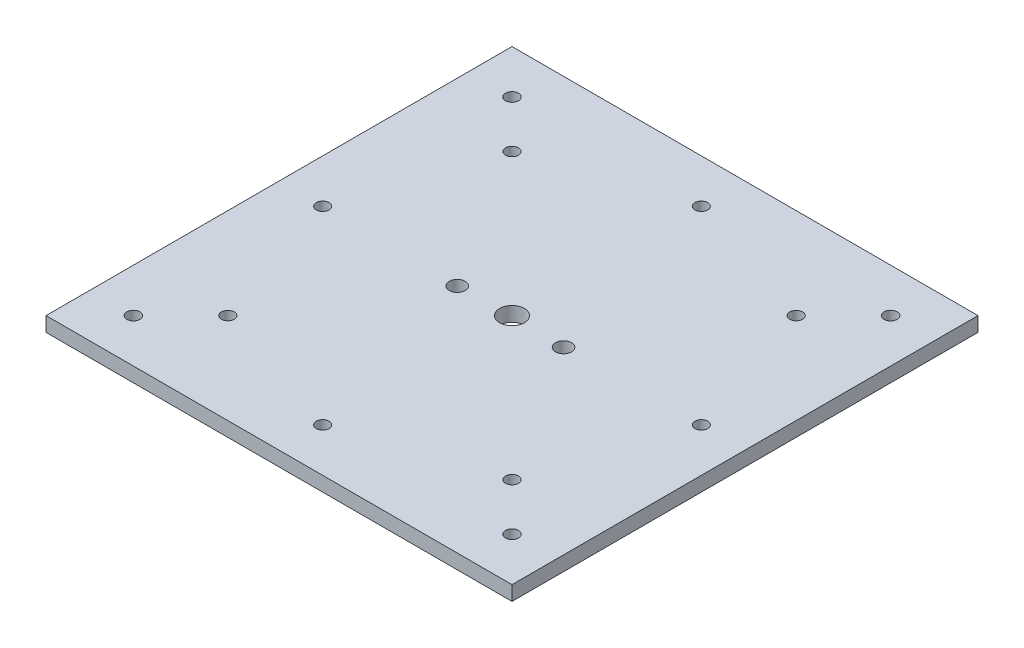
ISO-10303-21;
HEADER;
FILE_DESCRIPTION(('STEP AP214'),'2;1');
FILE_NAME('part.step','',(''),(''),'','','');
FILE_SCHEMA(('AUTOMOTIVE_DESIGN { 1 0 10303 214 1 1 1 1 }'));
ENDSEC;
DATA;
#1=APPLICATION_CONTEXT('core data for automotive mechanical design processes');
#2=APPLICATION_PROTOCOL_DEFINITION('international standard','automotive_design',2000,#1);
#3=PRODUCT_CONTEXT('',#1,'mechanical');
#4=PRODUCT('Part','Part','',(#3));
#5=PRODUCT_RELATED_PRODUCT_CATEGORY('part','',(#4));
#6=PRODUCT_DEFINITION_FORMATION('','',#4);
#7=PRODUCT_DEFINITION_CONTEXT('part definition',#1,'design');
#8=PRODUCT_DEFINITION('design','',#6,#7);
#9=PRODUCT_DEFINITION_SHAPE('','',#8);
#10=(LENGTH_UNIT() NAMED_UNIT(*) SI_UNIT(.MILLI.,.METRE.));
#11=(NAMED_UNIT(*) PLANE_ANGLE_UNIT() SI_UNIT($,.RADIAN.));
#12=(NAMED_UNIT(*) SI_UNIT($,.STERADIAN.) SOLID_ANGLE_UNIT());
#13=UNCERTAINTY_MEASURE_WITH_UNIT(LENGTH_MEASURE(1.E-05),#10,'distance_accuracy_value','');
#14=(GEOMETRIC_REPRESENTATION_CONTEXT(3) GLOBAL_UNCERTAINTY_ASSIGNED_CONTEXT((#13)) GLOBAL_UNIT_ASSIGNED_CONTEXT((#10,
#11,#12)) REPRESENTATION_CONTEXT('',''));
#15=CARTESIAN_POINT('',(0.,0.,0.));
#16=DIRECTION('',(0.,0.,1.));
#17=DIRECTION('',(1.,0.,0.));
#18=AXIS2_PLACEMENT_3D('',#15,#16,#17);
#19=CARTESIAN_POINT('',(0.,5.,0.));
#20=DIRECTION('',(0.,1.,0.));
#21=DIRECTION('',(0.,0.,1.));
#22=AXIS2_PLACEMENT_3D('',#19,#20,#21);
#23=PLANE('',#22);
#24=CARTESIAN_POINT('',(64.9999999999999,5.,65.));
#25=DIRECTION('',(0.,1.,0.));
#26=DIRECTION('',(0.,0.,1.));
#27=AXIS2_PLACEMENT_3D('',#24,#25,#26);
#28=CIRCLE('',#27,2.25);
#29=CARTESIAN_POINT('',(64.9999999999999,5.,67.25));
#30=VERTEX_POINT('',#29);
#31=EDGE_CURVE('E242',#30,#30,#28,.T.);
#32=ORIENTED_EDGE('',*,*,#31,.F.);
#33=EDGE_LOOP('',(#32));
#34=FACE_BOUND('',#33,.T.);
#35=CARTESIAN_POINT('',(-64.9999999999963,5.,3.69149155687865E-12));
#36=DIRECTION('',(0.,1.,0.));
#37=DIRECTION('',(0.,0.,1.));
#38=AXIS2_PLACEMENT_3D('',#35,#36,#37);
#39=CIRCLE('',#38,2.20000000000526);
#40=CARTESIAN_POINT('',(-64.9999999999963,5.,2.20000000000895));
#41=VERTEX_POINT('',#40);
#42=EDGE_CURVE('E226',#41,#41,#39,.T.);
#43=ORIENTED_EDGE('',*,*,#42,.F.);
#44=EDGE_LOOP('',(#43));
#45=FACE_BOUND('',#44,.T.);
#46=CARTESIAN_POINT('',(-18.2275786448242,5.,0.571625497658379));
#47=DIRECTION('',(0.,1.,0.));
#48=DIRECTION('',(0.,0.,1.));
#49=AXIS2_PLACEMENT_3D('',#46,#47,#48);
#50=CIRCLE('',#49,2.75);
#51=CARTESIAN_POINT('',(-18.2275786448242,5.,3.32162549765838));
#52=VERTEX_POINT('',#51);
#53=EDGE_CURVE('E210',#52,#52,#50,.T.);
#54=ORIENTED_EDGE('',*,*,#53,.F.);
#55=EDGE_LOOP('',(#54));
#56=FACE_BOUND('',#55,.T.);
#57=CARTESIAN_POINT('',(0.,5.,0.));
#58=DIRECTION('',(0.,1.,0.));
#59=DIRECTION('',(0.,0.,1.));
#60=AXIS2_PLACEMENT_3D('',#57,#58,#59);
#61=CIRCLE('',#60,4.25);
#62=CARTESIAN_POINT('',(0.,5.,4.25));
#63=VERTEX_POINT('',#62);
#64=EDGE_CURVE('E194',#63,#63,#61,.T.);
#65=ORIENTED_EDGE('',*,*,#64,.F.);
#66=EDGE_LOOP('',(#65));
#67=FACE_BOUND('',#66,.T.);
#68=CARTESIAN_POINT('',(65.0000000000037,5.,-3.66373598126302E-12));
#69=DIRECTION('',(0.,1.,0.));
#70=DIRECTION('',(0.,0.,1.));
#71=AXIS2_PLACEMENT_3D('',#68,#69,#70);
#72=CIRCLE('',#71,2.20000000000267);
#73=CARTESIAN_POINT('',(65.0000000000037,5.,2.199999999999));
#74=VERTEX_POINT('',#73);
#75=EDGE_CURVE('E178',#74,#74,#72,.T.);
#76=ORIENTED_EDGE('',*,*,#75,.F.);
#77=EDGE_LOOP('',(#76));
#78=FACE_BOUND('',#77,.T.);
#79=CARTESIAN_POINT('',(-65.,5.,-65.));
#80=DIRECTION('',(0.,1.,0.));
#81=DIRECTION('',(0.,0.,1.));
#82=AXIS2_PLACEMENT_3D('',#79,#80,#81);
#83=CIRCLE('',#82,2.25);
#84=CARTESIAN_POINT('',(-65.,5.,-62.75));
#85=VERTEX_POINT('',#84);
#86=EDGE_CURVE('E162',#85,#85,#83,.T.);
#87=ORIENTED_EDGE('',*,*,#86,.F.);
#88=EDGE_LOOP('',(#87));
#89=FACE_BOUND('',#88,.T.);
#90=CARTESIAN_POINT('',(48.7903679018732,5.,-48.7903679018752));
#91=DIRECTION('',(0.,1.,0.));
#92=DIRECTION('',(0.,0.,1.));
#93=AXIS2_PLACEMENT_3D('',#90,#91,#92);
#94=CIRCLE('',#93,2.20000000000049);
#95=CARTESIAN_POINT('',(48.7903679018732,5.,-46.5903679018747));
#96=VERTEX_POINT('',#95);
#97=EDGE_CURVE('E146',#96,#96,#94,.T.);
#98=ORIENTED_EDGE('',*,*,#97,.F.);
#99=EDGE_LOOP('',(#98));
#100=FACE_BOUND('',#99,.T.);
#101=DIRECTION('',(0.,0.,-1.));
#102=VECTOR('',#101,1.);
#103=CARTESIAN_POINT('',(80.,5.,-80.));
#104=LINE('',#103,#102);
#105=CARTESIAN_POINT('',(80.,5.,80.));
#106=VERTEX_POINT('',#105);
#107=CARTESIAN_POINT('',(80.,5.,-80.));
#108=VERTEX_POINT('',#107);
#109=EDGE_CURVE('E101',#106,#108,#104,.T.);
#110=ORIENTED_EDGE('',*,*,#109,.T.);
#111=DIRECTION('',(-1.,0.,0.));
#112=VECTOR('',#111,1.);
#113=CARTESIAN_POINT('',(-80.,5.,-80.));
#114=LINE('',#113,#112);
#115=CARTESIAN_POINT('',(-80.,5.,-80.));
#116=VERTEX_POINT('',#115);
#117=EDGE_CURVE('E96',#108,#116,#114,.T.);
#118=ORIENTED_EDGE('',*,*,#117,.T.);
#119=DIRECTION('',(0.,0.,1.));
#120=VECTOR('',#119,1.);
#121=CARTESIAN_POINT('',(-80.,5.,-80.));
#122=LINE('',#121,#120);
#123=CARTESIAN_POINT('',(-80.,5.,80.));
#124=VERTEX_POINT('',#123);
#125=EDGE_CURVE('E99',#116,#124,#122,.T.);
#126=ORIENTED_EDGE('',*,*,#125,.T.);
#127=DIRECTION('',(1.,0.,0.));
#128=VECTOR('',#127,1.);
#129=CARTESIAN_POINT('',(-80.,5.,80.));
#130=LINE('',#129,#128);
#131=EDGE_CURVE('E66',#124,#106,#130,.T.);
#132=ORIENTED_EDGE('',*,*,#131,.T.);
#133=EDGE_LOOP('',(#110,#118,#126,#132));
#134=FACE_BOUND('',#133,.T.);
#135=CARTESIAN_POINT('',(0.,5.,-65.));
#136=DIRECTION('',(0.,1.,0.));
#137=DIRECTION('',(0.,0.,1.));
#138=AXIS2_PLACEMENT_3D('',#135,#136,#137);
#139=CIRCLE('',#138,2.2);
#140=CARTESIAN_POINT('',(0.,5.,-62.8));
#141=VERTEX_POINT('',#140);
#142=EDGE_CURVE('E122',#141,#141,#139,.T.);
#143=ORIENTED_EDGE('',*,*,#142,.F.);
#144=EDGE_LOOP('',(#143));
#145=FACE_BOUND('',#144,.T.);
#146=CARTESIAN_POINT('',(48.7903679018801,5.,48.7903679018683));
#147=DIRECTION('',(0.,1.,0.));
#148=DIRECTION('',(0.,0.,1.));
#149=AXIS2_PLACEMENT_3D('',#146,#147,#148);
#150=CIRCLE('',#149,2.20000000000736);
#151=CARTESIAN_POINT('',(48.7903679018801,5.,50.9903679018757));
#152=VERTEX_POINT('',#151);
#153=EDGE_CURVE('E154',#152,#152,#150,.T.);
#154=ORIENTED_EDGE('',*,*,#153,.F.);
#155=EDGE_LOOP('',(#154));
#156=FACE_BOUND('',#155,.T.);
#157=CARTESIAN_POINT('',(-48.7903679018634,5.,48.7903679018753));
#158=DIRECTION('',(0.,1.,0.));
#159=DIRECTION('',(0.,0.,1.));
#160=AXIS2_PLACEMENT_3D('',#157,#158,#159);
#161=CIRCLE('',#160,2.2000000000096);
#162=CARTESIAN_POINT('',(-48.7903679018634,5.,50.9903679018849));
#163=VERTEX_POINT('',#162);
#164=EDGE_CURVE('E170',#163,#163,#161,.T.);
#165=ORIENTED_EDGE('',*,*,#164,.F.);
#166=EDGE_LOOP('',(#165));
#167=FACE_BOUND('',#166,.T.);
#168=CARTESIAN_POINT('',(-48.7903679018704,5.,-48.7903679018683));
#169=DIRECTION('',(0.,1.,0.));
#170=DIRECTION('',(0.,0.,1.));
#171=AXIS2_PLACEMENT_3D('',#168,#169,#170);
#172=CIRCLE('',#171,2.20000000000323);
#173=CARTESIAN_POINT('',(-48.7903679018704,5.,-46.5903679018651));
#174=VERTEX_POINT('',#173);
#175=EDGE_CURVE('E186',#174,#174,#172,.T.);
#176=ORIENTED_EDGE('',*,*,#175,.F.);
#177=EDGE_LOOP('',(#176));
#178=FACE_BOUND('',#177,.T.);
#179=CARTESIAN_POINT('',(18.2724213551758,5.,0.571625497658379));
#180=DIRECTION('',(0.,1.,0.));
#181=DIRECTION('',(0.,0.,1.));
#182=AXIS2_PLACEMENT_3D('',#179,#180,#181);
#183=CIRCLE('',#182,2.74999999999999);
#184=CARTESIAN_POINT('',(18.2724213551758,5.,3.32162549765837));
#185=VERTEX_POINT('',#184);
#186=EDGE_CURVE('E202',#185,#185,#183,.T.);
#187=ORIENTED_EDGE('',*,*,#186,.F.);
#188=EDGE_LOOP('',(#187));
#189=FACE_BOUND('',#188,.T.);
#190=CARTESIAN_POINT('',(7.36910532594948E-12,5.,65.));
#191=DIRECTION('',(0.,1.,0.));
#192=DIRECTION('',(0.,0.,1.));
#193=AXIS2_PLACEMENT_3D('',#190,#191,#192);
#194=CIRCLE('',#193,2.2000000000075);
#195=CARTESIAN_POINT('',(7.36910532594948E-12,5.,67.2000000000075));
#196=VERTEX_POINT('',#195);
#197=EDGE_CURVE('E218',#196,#196,#194,.T.);
#198=ORIENTED_EDGE('',*,*,#197,.F.);
#199=EDGE_LOOP('',(#198));
#200=FACE_BOUND('',#199,.T.);
#201=CARTESIAN_POINT('',(65.,5.,-65.));
#202=DIRECTION('',(0.,1.,0.));
#203=DIRECTION('',(0.,0.,1.));
#204=AXIS2_PLACEMENT_3D('',#201,#202,#203);
#205=CIRCLE('',#204,2.25);
#206=CARTESIAN_POINT('',(65.,5.,-62.75));
#207=VERTEX_POINT('',#206);
#208=EDGE_CURVE('E234',#207,#207,#205,.T.);
#209=ORIENTED_EDGE('',*,*,#208,.F.);
#210=EDGE_LOOP('',(#209));
#211=FACE_BOUND('',#210,.T.);
#212=CARTESIAN_POINT('',(-65.0000000000001,5.,65.));
#213=DIRECTION('',(0.,1.,0.));
#214=DIRECTION('',(0.,0.,1.));
#215=AXIS2_PLACEMENT_3D('',#212,#213,#214);
#216=CIRCLE('',#215,2.25);
#217=CARTESIAN_POINT('',(-65.0000000000001,5.,67.25));
#218=VERTEX_POINT('',#217);
#219=EDGE_CURVE('E250',#218,#218,#216,.T.);
#220=ORIENTED_EDGE('',*,*,#219,.F.);
#221=EDGE_LOOP('',(#220));
#222=FACE_BOUND('',#221,.T.);
#223=ADVANCED_FACE('F48',(#34,#45,#56,#67,#78,#89,#100,#134,#145,#156,#167,#178,#189,#200,#211,
#222),#23,.T.);
#224=CARTESIAN_POINT('',(0.,0.,0.));
#225=DIRECTION('',(0.,1.,0.));
#226=DIRECTION('',(0.,0.,1.));
#227=AXIS2_PLACEMENT_3D('',#224,#225,#226);
#228=PLANE('',#227);
#229=DIRECTION('',(0.,0.,-1.));
#230=VECTOR('',#229,1.);
#231=CARTESIAN_POINT('',(80.,0.,-80.));
#232=LINE('',#231,#230);
#233=CARTESIAN_POINT('',(80.,0.,80.));
#234=VERTEX_POINT('',#233);
#235=CARTESIAN_POINT('',(80.,0.,-80.));
#236=VERTEX_POINT('',#235);
#237=EDGE_CURVE('E118',#234,#236,#232,.T.);
#238=ORIENTED_EDGE('',*,*,#237,.F.);
#239=DIRECTION('',(1.,0.,0.));
#240=VECTOR('',#239,1.);
#241=CARTESIAN_POINT('',(-80.,0.,80.));
#242=LINE('',#241,#240);
#243=CARTESIAN_POINT('',(-80.,0.,80.));
#244=VERTEX_POINT('',#243);
#245=EDGE_CURVE('E89',#244,#234,#242,.T.);
#246=ORIENTED_EDGE('',*,*,#245,.F.);
#247=DIRECTION('',(0.,0.,1.));
#248=VECTOR('',#247,1.);
#249=CARTESIAN_POINT('',(-80.,0.,-80.));
#250=LINE('',#249,#248);
#251=CARTESIAN_POINT('',(-80.,0.,-80.));
#252=VERTEX_POINT('',#251);
#253=EDGE_CURVE('E83',#252,#244,#250,.T.);
#254=ORIENTED_EDGE('',*,*,#253,.F.);
#255=DIRECTION('',(-1.,0.,0.));
#256=VECTOR('',#255,1.);
#257=CARTESIAN_POINT('',(-80.,0.,-80.));
#258=LINE('',#257,#256);
#259=EDGE_CURVE('E106',#236,#252,#258,.T.);
#260=ORIENTED_EDGE('',*,*,#259,.F.);
#261=EDGE_LOOP('',(#238,#246,#254,#260));
#262=FACE_BOUND('',#261,.T.);
#263=CARTESIAN_POINT('',(0.,0.,-65.));
#264=DIRECTION('',(0.,1.,0.));
#265=DIRECTION('',(0.,0.,1.));
#266=AXIS2_PLACEMENT_3D('',#263,#264,#265);
#267=CIRCLE('',#266,2.2);
#268=CARTESIAN_POINT('',(0.,0.,-62.8));
#269=VERTEX_POINT('',#268);
#270=EDGE_CURVE('E142',#269,#269,#267,.T.);
#271=ORIENTED_EDGE('',*,*,#270,.T.);
#272=EDGE_LOOP('',(#271));
#273=FACE_BOUND('',#272,.T.);
#274=CARTESIAN_POINT('',(48.7903679018732,0.,-48.7903679018752));
#275=DIRECTION('',(0.,1.,0.));
#276=DIRECTION('',(0.,0.,1.));
#277=AXIS2_PLACEMENT_3D('',#274,#275,#276);
#278=CIRCLE('',#277,2.20000000000049);
#279=CARTESIAN_POINT('',(48.7903679018732,0.,-46.5903679018747));
#280=VERTEX_POINT('',#279);
#281=EDGE_CURVE('E150',#280,#280,#278,.T.);
#282=ORIENTED_EDGE('',*,*,#281,.T.);
#283=EDGE_LOOP('',(#282));
#284=FACE_BOUND('',#283,.T.);
#285=CARTESIAN_POINT('',(48.7903679018801,0.,48.7903679018683));
#286=DIRECTION('',(0.,1.,0.));
#287=DIRECTION('',(0.,0.,1.));
#288=AXIS2_PLACEMENT_3D('',#285,#286,#287);
#289=CIRCLE('',#288,2.20000000000736);
#290=CARTESIAN_POINT('',(48.7903679018801,0.,50.9903679018757));
#291=VERTEX_POINT('',#290);
#292=EDGE_CURVE('E158',#291,#291,#289,.T.);
#293=ORIENTED_EDGE('',*,*,#292,.T.);
#294=EDGE_LOOP('',(#293));
#295=FACE_BOUND('',#294,.T.);
#296=CARTESIAN_POINT('',(-65.,0.,-65.));
#297=DIRECTION('',(0.,1.,0.));
#298=DIRECTION('',(0.,0.,1.));
#299=AXIS2_PLACEMENT_3D('',#296,#297,#298);
#300=CIRCLE('',#299,2.25);
#301=CARTESIAN_POINT('',(-65.,0.,-62.75));
#302=VERTEX_POINT('',#301);
#303=EDGE_CURVE('E166',#302,#302,#300,.T.);
#304=ORIENTED_EDGE('',*,*,#303,.T.);
#305=EDGE_LOOP('',(#304));
#306=FACE_BOUND('',#305,.T.);
#307=CARTESIAN_POINT('',(-48.7903679018634,0.,48.7903679018753));
#308=DIRECTION('',(0.,1.,0.));
#309=DIRECTION('',(0.,0.,1.));
#310=AXIS2_PLACEMENT_3D('',#307,#308,#309);
#311=CIRCLE('',#310,2.2000000000096);
#312=CARTESIAN_POINT('',(-48.7903679018634,0.,50.9903679018849));
#313=VERTEX_POINT('',#312);
#314=EDGE_CURVE('E174',#313,#313,#311,.T.);
#315=ORIENTED_EDGE('',*,*,#314,.T.);
#316=EDGE_LOOP('',(#315));
#317=FACE_BOUND('',#316,.T.);
#318=CARTESIAN_POINT('',(65.0000000000037,0.,-3.66373598126302E-12));
#319=DIRECTION('',(0.,1.,0.));
#320=DIRECTION('',(0.,0.,1.));
#321=AXIS2_PLACEMENT_3D('',#318,#319,#320);
#322=CIRCLE('',#321,2.20000000000267);
#323=CARTESIAN_POINT('',(65.0000000000037,0.,2.199999999999));
#324=VERTEX_POINT('',#323);
#325=EDGE_CURVE('E182',#324,#324,#322,.T.);
#326=ORIENTED_EDGE('',*,*,#325,.T.);
#327=EDGE_LOOP('',(#326));
#328=FACE_BOUND('',#327,.T.);
#329=CARTESIAN_POINT('',(-48.7903679018704,0.,-48.7903679018683));
#330=DIRECTION('',(0.,1.,0.));
#331=DIRECTION('',(0.,0.,1.));
#332=AXIS2_PLACEMENT_3D('',#329,#330,#331);
#333=CIRCLE('',#332,2.20000000000323);
#334=CARTESIAN_POINT('',(-48.7903679018704,0.,-46.5903679018651));
#335=VERTEX_POINT('',#334);
#336=EDGE_CURVE('E190',#335,#335,#333,.T.);
#337=ORIENTED_EDGE('',*,*,#336,.T.);
#338=EDGE_LOOP('',(#337));
#339=FACE_BOUND('',#338,.T.);
#340=CARTESIAN_POINT('',(0.,0.,0.));
#341=DIRECTION('',(0.,1.,0.));
#342=DIRECTION('',(0.,0.,1.));
#343=AXIS2_PLACEMENT_3D('',#340,#341,#342);
#344=CIRCLE('',#343,4.25);
#345=CARTESIAN_POINT('',(0.,0.,4.25));
#346=VERTEX_POINT('',#345);
#347=EDGE_CURVE('E198',#346,#346,#344,.T.);
#348=ORIENTED_EDGE('',*,*,#347,.T.);
#349=EDGE_LOOP('',(#348));
#350=FACE_BOUND('',#349,.T.);
#351=CARTESIAN_POINT('',(18.2724213551758,0.,0.571625497658379));
#352=DIRECTION('',(0.,1.,0.));
#353=DIRECTION('',(0.,0.,1.));
#354=AXIS2_PLACEMENT_3D('',#351,#352,#353);
#355=CIRCLE('',#354,2.74999999999999);
#356=CARTESIAN_POINT('',(18.2724213551758,0.,3.32162549765837));
#357=VERTEX_POINT('',#356);
#358=EDGE_CURVE('E206',#357,#357,#355,.T.);
#359=ORIENTED_EDGE('',*,*,#358,.T.);
#360=EDGE_LOOP('',(#359));
#361=FACE_BOUND('',#360,.T.);
#362=CARTESIAN_POINT('',(-18.2275786448242,0.,0.571625497658379));
#363=DIRECTION('',(0.,1.,0.));
#364=DIRECTION('',(0.,0.,1.));
#365=AXIS2_PLACEMENT_3D('',#362,#363,#364);
#366=CIRCLE('',#365,2.75);
#367=CARTESIAN_POINT('',(-18.2275786448242,0.,3.32162549765838));
#368=VERTEX_POINT('',#367);
#369=EDGE_CURVE('E214',#368,#368,#366,.T.);
#370=ORIENTED_EDGE('',*,*,#369,.T.);
#371=EDGE_LOOP('',(#370));
#372=FACE_BOUND('',#371,.T.);
#373=CARTESIAN_POINT('',(7.36910532594948E-12,0.,65.));
#374=DIRECTION('',(0.,1.,0.));
#375=DIRECTION('',(0.,0.,1.));
#376=AXIS2_PLACEMENT_3D('',#373,#374,#375);
#377=CIRCLE('',#376,2.2000000000075);
#378=CARTESIAN_POINT('',(7.36910532594948E-12,0.,67.2000000000075));
#379=VERTEX_POINT('',#378);
#380=EDGE_CURVE('E222',#379,#379,#377,.T.);
#381=ORIENTED_EDGE('',*,*,#380,.T.);
#382=EDGE_LOOP('',(#381));
#383=FACE_BOUND('',#382,.T.);
#384=CARTESIAN_POINT('',(-64.9999999999963,0.,3.69149155687865E-12));
#385=DIRECTION('',(0.,1.,0.));
#386=DIRECTION('',(0.,0.,1.));
#387=AXIS2_PLACEMENT_3D('',#384,#385,#386);
#388=CIRCLE('',#387,2.20000000000526);
#389=CARTESIAN_POINT('',(-64.9999999999963,0.,2.20000000000895));
#390=VERTEX_POINT('',#389);
#391=EDGE_CURVE('E230',#390,#390,#388,.T.);
#392=ORIENTED_EDGE('',*,*,#391,.T.);
#393=EDGE_LOOP('',(#392));
#394=FACE_BOUND('',#393,.T.);
#395=CARTESIAN_POINT('',(65.,0.,-65.));
#396=DIRECTION('',(0.,1.,0.));
#397=DIRECTION('',(0.,0.,1.));
#398=AXIS2_PLACEMENT_3D('',#395,#396,#397);
#399=CIRCLE('',#398,2.25);
#400=CARTESIAN_POINT('',(65.,0.,-62.75));
#401=VERTEX_POINT('',#400);
#402=EDGE_CURVE('E238',#401,#401,#399,.T.);
#403=ORIENTED_EDGE('',*,*,#402,.T.);
#404=EDGE_LOOP('',(#403));
#405=FACE_BOUND('',#404,.T.);
#406=CARTESIAN_POINT('',(64.9999999999999,0.,65.));
#407=DIRECTION('',(0.,1.,0.));
#408=DIRECTION('',(0.,0.,1.));
#409=AXIS2_PLACEMENT_3D('',#406,#407,#408);
#410=CIRCLE('',#409,2.25);
#411=CARTESIAN_POINT('',(64.9999999999999,0.,67.25));
#412=VERTEX_POINT('',#411);
#413=EDGE_CURVE('E246',#412,#412,#410,.T.);
#414=ORIENTED_EDGE('',*,*,#413,.T.);
#415=EDGE_LOOP('',(#414));
#416=FACE_BOUND('',#415,.T.);
#417=CARTESIAN_POINT('',(-65.0000000000001,0.,65.));
#418=DIRECTION('',(0.,1.,0.));
#419=DIRECTION('',(0.,0.,1.));
#420=AXIS2_PLACEMENT_3D('',#417,#418,#419);
#421=CIRCLE('',#420,2.25);
#422=CARTESIAN_POINT('',(-65.0000000000001,0.,67.25));
#423=VERTEX_POINT('',#422);
#424=EDGE_CURVE('E254',#423,#423,#421,.T.);
#425=ORIENTED_EDGE('',*,*,#424,.T.);
#426=EDGE_LOOP('',(#425));
#427=FACE_BOUND('',#426,.T.);
#428=ADVANCED_FACE('F136',(#262,#273,#284,#295,#306,#317,#328,#339,#350,#361,#372,#383,#394,
#405,#416,#427),#228,.F.);
#429=CARTESIAN_POINT('',(80.,5.,-80.));
#430=DIRECTION('',(-1.,0.,0.));
#431=DIRECTION('',(0.,0.,1.));
#432=AXIS2_PLACEMENT_3D('',#429,#430,#431);
#433=PLANE('',#432);
#434=ORIENTED_EDGE('',*,*,#237,.T.);
#435=DIRECTION('',(0.,-1.,0.));
#436=VECTOR('',#435,1.);
#437=CARTESIAN_POINT('',(80.,5.,-80.));
#438=LINE('',#437,#436);
#439=EDGE_CURVE('E13',#108,#236,#438,.T.);
#440=ORIENTED_EDGE('',*,*,#439,.F.);
#441=ORIENTED_EDGE('',*,*,#109,.F.);
#442=DIRECTION('',(0.,-1.,0.));
#443=VECTOR('',#442,1.);
#444=CARTESIAN_POINT('',(80.,5.,80.));
#445=LINE('',#444,#443);
#446=EDGE_CURVE('E114',#106,#234,#445,.T.);
#447=ORIENTED_EDGE('',*,*,#446,.T.);
#448=EDGE_LOOP('',(#434,#440,#441,#447));
#449=FACE_BOUND('',#448,.T.);
#450=ADVANCED_FACE('F50',(#449),#433,.F.);
#451=CARTESIAN_POINT('',(-80.,5.,-80.));
#452=DIRECTION('',(0.,0.,1.));
#453=DIRECTION('',(1.,0.,0.));
#454=AXIS2_PLACEMENT_3D('',#451,#452,#453);
#455=PLANE('',#454);
#456=ORIENTED_EDGE('',*,*,#259,.T.);
#457=DIRECTION('',(0.,-1.,0.));
#458=VECTOR('',#457,1.);
#459=CARTESIAN_POINT('',(-80.,5.,-80.));
#460=LINE('',#459,#458);
#461=EDGE_CURVE('E58',#116,#252,#460,.T.);
#462=ORIENTED_EDGE('',*,*,#461,.F.);
#463=ORIENTED_EDGE('',*,*,#117,.F.);
#464=ORIENTED_EDGE('',*,*,#439,.T.);
#465=EDGE_LOOP('',(#456,#462,#463,#464));
#466=FACE_BOUND('',#465,.T.);
#467=ADVANCED_FACE('F105',(#466),#455,.F.);
#468=CARTESIAN_POINT('',(-80.,5.,-80.));
#469=DIRECTION('',(1.,0.,0.));
#470=DIRECTION('',(0.,0.,-1.));
#471=AXIS2_PLACEMENT_3D('',#468,#469,#470);
#472=PLANE('',#471);
#473=ORIENTED_EDGE('',*,*,#253,.T.);
#474=DIRECTION('',(0.,-1.,0.));
#475=VECTOR('',#474,1.);
#476=CARTESIAN_POINT('',(-80.,5.,80.));
#477=LINE('',#476,#475);
#478=EDGE_CURVE('E108',#124,#244,#477,.T.);
#479=ORIENTED_EDGE('',*,*,#478,.F.);
#480=ORIENTED_EDGE('',*,*,#125,.F.);
#481=ORIENTED_EDGE('',*,*,#461,.T.);
#482=EDGE_LOOP('',(#473,#479,#480,#481));
#483=FACE_BOUND('',#482,.T.);
#484=ADVANCED_FACE('F109',(#483),#472,.F.);
#485=CARTESIAN_POINT('',(-80.,5.,80.));
#486=DIRECTION('',(0.,0.,-1.));
#487=DIRECTION('',(-1.,0.,0.));
#488=AXIS2_PLACEMENT_3D('',#485,#486,#487);
#489=PLANE('',#488);
#490=ORIENTED_EDGE('',*,*,#245,.T.);
#491=ORIENTED_EDGE('',*,*,#446,.F.);
#492=ORIENTED_EDGE('',*,*,#131,.F.);
#493=ORIENTED_EDGE('',*,*,#478,.T.);
#494=EDGE_LOOP('',(#490,#491,#492,#493));
#495=FACE_BOUND('',#494,.T.);
#496=ADVANCED_FACE('F133',(#495),#489,.F.);
#497=CARTESIAN_POINT('',(0.,5.,-65.));
#498=DIRECTION('',(0.,-1.,0.));
#499=DIRECTION('',(0.,0.,-1.));
#500=AXIS2_PLACEMENT_3D('',#497,#498,#499);
#501=CYLINDRICAL_SURFACE('',#500,2.2);
#502=ORIENTED_EDGE('',*,*,#142,.T.);
#503=EDGE_LOOP('',(#502));
#504=FACE_BOUND('',#503,.T.);
#505=ORIENTED_EDGE('',*,*,#270,.F.);
#506=EDGE_LOOP('',(#505));
#507=FACE_BOUND('',#506,.T.);
#508=ADVANCED_FACE('F276',(#504,#507),#501,.F.);
#509=CARTESIAN_POINT('',(48.7903679018732,5.,-48.7903679018752));
#510=DIRECTION('',(0.,-1.,0.));
#511=DIRECTION('',(0.,0.,-1.));
#512=AXIS2_PLACEMENT_3D('',#509,#510,#511);
#513=CYLINDRICAL_SURFACE('',#512,2.20000000000049);
#514=ORIENTED_EDGE('',*,*,#97,.T.);
#515=EDGE_LOOP('',(#514));
#516=FACE_BOUND('',#515,.T.);
#517=ORIENTED_EDGE('',*,*,#281,.F.);
#518=EDGE_LOOP('',(#517));
#519=FACE_BOUND('',#518,.T.);
#520=ADVANCED_FACE('F322',(#516,#519),#513,.F.);
#521=CARTESIAN_POINT('',(48.7903679018801,5.,48.7903679018683));
#522=DIRECTION('',(0.,-1.,0.));
#523=DIRECTION('',(0.,0.,-1.));
#524=AXIS2_PLACEMENT_3D('',#521,#522,#523);
#525=CYLINDRICAL_SURFACE('',#524,2.20000000000736);
#526=ORIENTED_EDGE('',*,*,#153,.T.);
#527=EDGE_LOOP('',(#526));
#528=FACE_BOUND('',#527,.T.);
#529=ORIENTED_EDGE('',*,*,#292,.F.);
#530=EDGE_LOOP('',(#529));
#531=FACE_BOUND('',#530,.T.);
#532=ADVANCED_FACE('F330',(#528,#531),#525,.F.);
#533=CARTESIAN_POINT('',(-65.,5.,-65.));
#534=DIRECTION('',(0.,-1.,0.));
#535=DIRECTION('',(0.,0.,-1.));
#536=AXIS2_PLACEMENT_3D('',#533,#534,#535);
#537=CYLINDRICAL_SURFACE('',#536,2.25);
#538=ORIENTED_EDGE('',*,*,#86,.T.);
#539=EDGE_LOOP('',(#538));
#540=FACE_BOUND('',#539,.T.);
#541=ORIENTED_EDGE('',*,*,#303,.F.);
#542=EDGE_LOOP('',(#541));
#543=FACE_BOUND('',#542,.T.);
#544=ADVANCED_FACE('F338',(#540,#543),#537,.F.);
#545=CARTESIAN_POINT('',(-48.7903679018634,5.,48.7903679018753));
#546=DIRECTION('',(0.,-1.,0.));
#547=DIRECTION('',(0.,0.,-1.));
#548=AXIS2_PLACEMENT_3D('',#545,#546,#547);
#549=CYLINDRICAL_SURFACE('',#548,2.2000000000096);
#550=ORIENTED_EDGE('',*,*,#164,.T.);
#551=EDGE_LOOP('',(#550));
#552=FACE_BOUND('',#551,.T.);
#553=ORIENTED_EDGE('',*,*,#314,.F.);
#554=EDGE_LOOP('',(#553));
#555=FACE_BOUND('',#554,.T.);
#556=ADVANCED_FACE('F347',(#552,#555),#549,.F.);
#557=CARTESIAN_POINT('',(65.0000000000037,5.,-3.66373598126302E-12));
#558=DIRECTION('',(0.,-1.,0.));
#559=DIRECTION('',(0.,0.,-1.));
#560=AXIS2_PLACEMENT_3D('',#557,#558,#559);
#561=CYLINDRICAL_SURFACE('',#560,2.20000000000267);
#562=ORIENTED_EDGE('',*,*,#75,.T.);
#563=EDGE_LOOP('',(#562));
#564=FACE_BOUND('',#563,.T.);
#565=ORIENTED_EDGE('',*,*,#325,.F.);
#566=EDGE_LOOP('',(#565));
#567=FACE_BOUND('',#566,.T.);
#568=ADVANCED_FACE('F356',(#564,#567),#561,.F.);
#569=CARTESIAN_POINT('',(-48.7903679018704,5.,-48.7903679018683));
#570=DIRECTION('',(0.,-1.,0.));
#571=DIRECTION('',(0.,0.,-1.));
#572=AXIS2_PLACEMENT_3D('',#569,#570,#571);
#573=CYLINDRICAL_SURFACE('',#572,2.20000000000323);
#574=ORIENTED_EDGE('',*,*,#175,.T.);
#575=EDGE_LOOP('',(#574));
#576=FACE_BOUND('',#575,.T.);
#577=ORIENTED_EDGE('',*,*,#336,.F.);
#578=EDGE_LOOP('',(#577));
#579=FACE_BOUND('',#578,.T.);
#580=ADVANCED_FACE('F365',(#576,#579),#573,.F.);
#581=CARTESIAN_POINT('',(0.,5.,0.));
#582=DIRECTION('',(0.,-1.,0.));
#583=DIRECTION('',(0.,0.,-1.));
#584=AXIS2_PLACEMENT_3D('',#581,#582,#583);
#585=CYLINDRICAL_SURFACE('',#584,4.25);
#586=ORIENTED_EDGE('',*,*,#64,.T.);
#587=EDGE_LOOP('',(#586));
#588=FACE_BOUND('',#587,.T.);
#589=ORIENTED_EDGE('',*,*,#347,.F.);
#590=EDGE_LOOP('',(#589));
#591=FACE_BOUND('',#590,.T.);
#592=ADVANCED_FACE('F374',(#588,#591),#585,.F.);
#593=CARTESIAN_POINT('',(18.2724213551758,5.,0.571625497658379));
#594=DIRECTION('',(0.,-1.,0.));
#595=DIRECTION('',(0.,0.,-1.));
#596=AXIS2_PLACEMENT_3D('',#593,#594,#595);
#597=CYLINDRICAL_SURFACE('',#596,2.74999999999999);
#598=ORIENTED_EDGE('',*,*,#186,.T.);
#599=EDGE_LOOP('',(#598));
#600=FACE_BOUND('',#599,.T.);
#601=ORIENTED_EDGE('',*,*,#358,.F.);
#602=EDGE_LOOP('',(#601));
#603=FACE_BOUND('',#602,.T.);
#604=ADVANCED_FACE('F383',(#600,#603),#597,.F.);
#605=CARTESIAN_POINT('',(-18.2275786448242,5.,0.571625497658379));
#606=DIRECTION('',(0.,-1.,0.));
#607=DIRECTION('',(0.,0.,-1.));
#608=AXIS2_PLACEMENT_3D('',#605,#606,#607);
#609=CYLINDRICAL_SURFACE('',#608,2.75);
#610=ORIENTED_EDGE('',*,*,#53,.T.);
#611=EDGE_LOOP('',(#610));
#612=FACE_BOUND('',#611,.T.);
#613=ORIENTED_EDGE('',*,*,#369,.F.);
#614=EDGE_LOOP('',(#613));
#615=FACE_BOUND('',#614,.T.);
#616=ADVANCED_FACE('F392',(#612,#615),#609,.F.);
#617=CARTESIAN_POINT('',(7.36910532594948E-12,5.,65.));
#618=DIRECTION('',(0.,-1.,0.));
#619=DIRECTION('',(0.,0.,-1.));
#620=AXIS2_PLACEMENT_3D('',#617,#618,#619);
#621=CYLINDRICAL_SURFACE('',#620,2.2000000000075);
#622=ORIENTED_EDGE('',*,*,#197,.T.);
#623=EDGE_LOOP('',(#622));
#624=FACE_BOUND('',#623,.T.);
#625=ORIENTED_EDGE('',*,*,#380,.F.);
#626=EDGE_LOOP('',(#625));
#627=FACE_BOUND('',#626,.T.);
#628=ADVANCED_FACE('F401',(#624,#627),#621,.F.);
#629=CARTESIAN_POINT('',(-64.9999999999963,5.,3.69149155687865E-12));
#630=DIRECTION('',(0.,-1.,0.));
#631=DIRECTION('',(0.,0.,-1.));
#632=AXIS2_PLACEMENT_3D('',#629,#630,#631);
#633=CYLINDRICAL_SURFACE('',#632,2.20000000000526);
#634=ORIENTED_EDGE('',*,*,#42,.T.);
#635=EDGE_LOOP('',(#634));
#636=FACE_BOUND('',#635,.T.);
#637=ORIENTED_EDGE('',*,*,#391,.F.);
#638=EDGE_LOOP('',(#637));
#639=FACE_BOUND('',#638,.T.);
#640=ADVANCED_FACE('F410',(#636,#639),#633,.F.);
#641=CARTESIAN_POINT('',(65.,5.,-65.));
#642=DIRECTION('',(0.,-1.,0.));
#643=DIRECTION('',(0.,0.,-1.));
#644=AXIS2_PLACEMENT_3D('',#641,#642,#643);
#645=CYLINDRICAL_SURFACE('',#644,2.25);
#646=ORIENTED_EDGE('',*,*,#208,.T.);
#647=EDGE_LOOP('',(#646));
#648=FACE_BOUND('',#647,.T.);
#649=ORIENTED_EDGE('',*,*,#402,.F.);
#650=EDGE_LOOP('',(#649));
#651=FACE_BOUND('',#650,.T.);
#652=ADVANCED_FACE('F419',(#648,#651),#645,.F.);
#653=CARTESIAN_POINT('',(64.9999999999999,5.,65.));
#654=DIRECTION('',(0.,-1.,0.));
#655=DIRECTION('',(0.,0.,-1.));
#656=AXIS2_PLACEMENT_3D('',#653,#654,#655);
#657=CYLINDRICAL_SURFACE('',#656,2.25);
#658=ORIENTED_EDGE('',*,*,#31,.T.);
#659=EDGE_LOOP('',(#658));
#660=FACE_BOUND('',#659,.T.);
#661=ORIENTED_EDGE('',*,*,#413,.F.);
#662=EDGE_LOOP('',(#661));
#663=FACE_BOUND('',#662,.T.);
#664=ADVANCED_FACE('F428',(#660,#663),#657,.F.);
#665=CARTESIAN_POINT('',(-65.0000000000001,5.,65.));
#666=DIRECTION('',(0.,-1.,0.));
#667=DIRECTION('',(0.,0.,-1.));
#668=AXIS2_PLACEMENT_3D('',#665,#666,#667);
#669=CYLINDRICAL_SURFACE('',#668,2.25);
#670=ORIENTED_EDGE('',*,*,#219,.T.);
#671=EDGE_LOOP('',(#670));
#672=FACE_BOUND('',#671,.T.);
#673=ORIENTED_EDGE('',*,*,#424,.F.);
#674=EDGE_LOOP('',(#673));
#675=FACE_BOUND('',#674,.T.);
#676=ADVANCED_FACE('F263',(#672,#675),#669,.F.);
#677=CLOSED_SHELL('',(#223,#428,#450,#467,#484,#496,#508,#520,#532,#544,#556,#568,#580,#592,
#604,#616,#628,#640,#652,#664,#676));
#678=MANIFOLD_SOLID_BREP('B2',#677);
#679=ADVANCED_BREP_SHAPE_REPRESENTATION('',(#18,#678),#14);
#680=SHAPE_DEFINITION_REPRESENTATION(#9,#679);
ENDSEC;
END-ISO-10303-21;
